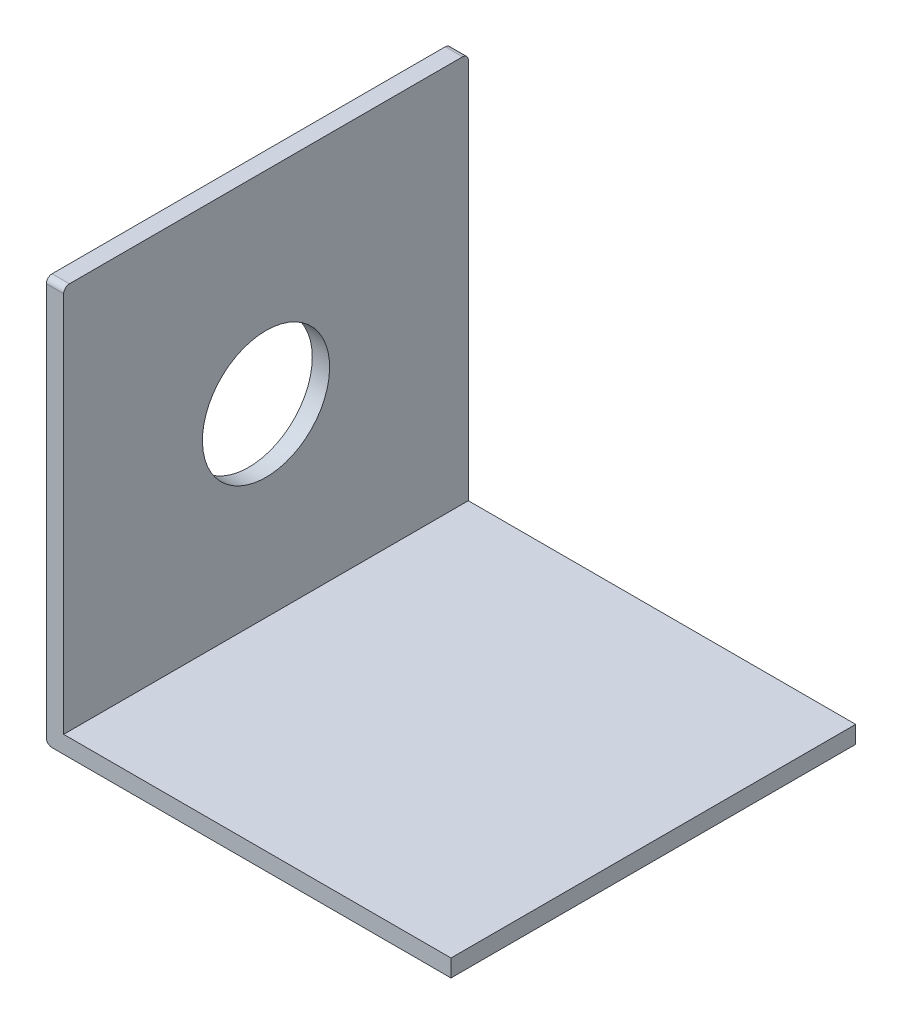
ISO-10303-21;
HEADER;
FILE_DESCRIPTION(('STEP AP214'),'2;1');
FILE_NAME('part.step','',(''),(''),'','','');
FILE_SCHEMA(('AUTOMOTIVE_DESIGN { 1 0 10303 214 1 1 1 1 }'));
ENDSEC;
DATA;
#1=APPLICATION_CONTEXT('core data for automotive mechanical design processes');
#2=APPLICATION_PROTOCOL_DEFINITION('international standard','automotive_design',2000,#1);
#3=PRODUCT_CONTEXT('',#1,'mechanical');
#4=PRODUCT('Part','Part','',(#3));
#5=PRODUCT_RELATED_PRODUCT_CATEGORY('part','',(#4));
#6=PRODUCT_DEFINITION_FORMATION('','',#4);
#7=PRODUCT_DEFINITION_CONTEXT('part definition',#1,'design');
#8=PRODUCT_DEFINITION('design','',#6,#7);
#9=PRODUCT_DEFINITION_SHAPE('','',#8);
#10=(LENGTH_UNIT() NAMED_UNIT(*) SI_UNIT(.MILLI.,.METRE.));
#11=(NAMED_UNIT(*) PLANE_ANGLE_UNIT() SI_UNIT($,.RADIAN.));
#12=(NAMED_UNIT(*) SI_UNIT($,.STERADIAN.) SOLID_ANGLE_UNIT());
#13=UNCERTAINTY_MEASURE_WITH_UNIT(LENGTH_MEASURE(1.E-05),#10,'distance_accuracy_value','');
#14=(GEOMETRIC_REPRESENTATION_CONTEXT(3) GLOBAL_UNCERTAINTY_ASSIGNED_CONTEXT((#13)) GLOBAL_UNIT_ASSIGNED_CONTEXT((#10,
#11,#12)) REPRESENTATION_CONTEXT('',''));
#15=CARTESIAN_POINT('',(0.,0.,0.));
#16=DIRECTION('',(0.,0.,1.));
#17=DIRECTION('',(1.,0.,0.));
#18=AXIS2_PLACEMENT_3D('',#15,#16,#17);
#19=CARTESIAN_POINT('',(0.,0.,70.));
#20=DIRECTION('',(1.,0.,0.));
#21=DIRECTION('',(0.,0.,-1.));
#22=AXIS2_PLACEMENT_3D('',#19,#20,#21);
#23=PLANE('',#22);
#24=CARTESIAN_POINT('',(0.,35.,35.));
#25=DIRECTION('',(1.,0.,0.));
#26=DIRECTION('',(0.,0.,-1.));
#27=AXIS2_PLACEMENT_3D('',#24,#25,#26);
#28=CIRCLE('',#27,11.);
#29=CARTESIAN_POINT('',(0.,35.,24.));
#30=VERTEX_POINT('',#29);
#31=EDGE_CURVE('E153',#30,#30,#28,.T.);
#32=ORIENTED_EDGE('',*,*,#31,.T.);
#33=EDGE_LOOP('',(#32));
#34=FACE_BOUND('',#33,.T.);
#35=DIRECTION('',(0.,-1.,0.));
#36=VECTOR('',#35,1.);
#37=CARTESIAN_POINT('',(0.,0.,70.));
#38=LINE('',#37,#36);
#39=CARTESIAN_POINT('',(0.,69.,70.));
#40=VERTEX_POINT('',#39);
#41=CARTESIAN_POINT('',(0.,1.,70.));
#42=VERTEX_POINT('',#41);
#43=EDGE_CURVE('E122',#40,#42,#38,.T.);
#44=ORIENTED_EDGE('',*,*,#43,.F.);
#45=CARTESIAN_POINT('',(0.,69.,69.));
#46=DIRECTION('',(1.,0.,0.));
#47=DIRECTION('',(0.,0.,-1.));
#48=AXIS2_PLACEMENT_3D('',#45,#46,#47);
#49=CIRCLE('',#48,1.);
#50=CARTESIAN_POINT('',(0.,70.,69.));
#51=VERTEX_POINT('',#50);
#52=EDGE_CURVE('E196',#40,#51,#49,.F.);
#53=ORIENTED_EDGE('',*,*,#52,.T.);
#54=DIRECTION('',(0.,0.,-1.));
#55=VECTOR('',#54,1.);
#56=CARTESIAN_POINT('',(0.,70.,70.));
#57=LINE('',#56,#55);
#58=CARTESIAN_POINT('',(0.,70.,1.));
#59=VERTEX_POINT('',#58);
#60=EDGE_CURVE('E149',#51,#59,#57,.T.);
#61=ORIENTED_EDGE('',*,*,#60,.T.);
#62=CARTESIAN_POINT('',(0.,69.,1.));
#63=DIRECTION('',(1.,0.,0.));
#64=DIRECTION('',(0.,0.,-1.));
#65=AXIS2_PLACEMENT_3D('',#62,#63,#64);
#66=CIRCLE('',#65,1.);
#67=CARTESIAN_POINT('',(0.,69.,0.));
#68=VERTEX_POINT('',#67);
#69=EDGE_CURVE('E193',#59,#68,#66,.F.);
#70=ORIENTED_EDGE('',*,*,#69,.T.);
#71=DIRECTION('',(0.,-1.,0.));
#72=VECTOR('',#71,1.);
#73=CARTESIAN_POINT('',(0.,0.,0.));
#74=LINE('',#73,#72);
#75=CARTESIAN_POINT('',(0.,1.,0.));
#76=VERTEX_POINT('',#75);
#77=EDGE_CURVE('E150',#68,#76,#74,.T.);
#78=ORIENTED_EDGE('',*,*,#77,.T.);
#79=DIRECTION('',(0.,0.,-1.));
#80=VECTOR('',#79,1.);
#81=CARTESIAN_POINT('',(0.,1.,70.));
#82=LINE('',#81,#80);
#83=EDGE_CURVE('E183',#76,#42,#82,.F.);
#84=ORIENTED_EDGE('',*,*,#83,.T.);
#85=EDGE_LOOP('',(#44,#53,#61,#70,#78,#84));
#86=FACE_BOUND('',#85,.T.);
#87=ADVANCED_FACE('F37',(#34,#86),#23,.F.);
#88=CARTESIAN_POINT('',(0.,0.,70.));
#89=DIRECTION('',(0.,1.,0.));
#90=DIRECTION('',(0.,0.,1.));
#91=AXIS2_PLACEMENT_3D('',#88,#89,#90);
#92=PLANE('',#91);
#93=DIRECTION('',(1.,0.,0.));
#94=VECTOR('',#93,1.);
#95=CARTESIAN_POINT('',(0.,0.,70.));
#96=LINE('',#95,#94);
#97=CARTESIAN_POINT('',(1.,0.,70.));
#98=VERTEX_POINT('',#97);
#99=CARTESIAN_POINT('',(70.,0.,70.));
#100=VERTEX_POINT('',#99);
#101=EDGE_CURVE('E109',#98,#100,#96,.T.);
#102=ORIENTED_EDGE('',*,*,#101,.F.);
#103=DIRECTION('',(0.,0.,-1.));
#104=VECTOR('',#103,1.);
#105=CARTESIAN_POINT('',(1.,0.,70.));
#106=LINE('',#105,#104);
#107=CARTESIAN_POINT('',(1.,0.,0.));
#108=VERTEX_POINT('',#107);
#109=EDGE_CURVE('E132',#98,#108,#106,.T.);
#110=ORIENTED_EDGE('',*,*,#109,.T.);
#111=DIRECTION('',(1.,0.,0.));
#112=VECTOR('',#111,1.);
#113=CARTESIAN_POINT('',(0.,0.,0.));
#114=LINE('',#113,#112);
#115=CARTESIAN_POINT('',(70.,0.,0.));
#116=VERTEX_POINT('',#115);
#117=EDGE_CURVE('E128',#108,#116,#114,.T.);
#118=ORIENTED_EDGE('',*,*,#117,.T.);
#119=DIRECTION('',(0.,0.,-1.));
#120=VECTOR('',#119,1.);
#121=CARTESIAN_POINT('',(70.,0.,70.));
#122=LINE('',#121,#120);
#123=EDGE_CURVE('E125',#100,#116,#122,.T.);
#124=ORIENTED_EDGE('',*,*,#123,.F.);
#125=EDGE_LOOP('',(#102,#110,#118,#124));
#126=FACE_BOUND('',#125,.T.);
#127=ADVANCED_FACE('F126',(#126),#92,.F.);
#128=CARTESIAN_POINT('',(70.,3.,70.));
#129=DIRECTION('',(-1.,0.,0.));
#130=DIRECTION('',(0.,0.,1.));
#131=AXIS2_PLACEMENT_3D('',#128,#129,#130);
#132=PLANE('',#131);
#133=DIRECTION('',(0.,1.,0.));
#134=VECTOR('',#133,1.);
#135=CARTESIAN_POINT('',(70.,3.,0.));
#136=LINE('',#135,#134);
#137=CARTESIAN_POINT('',(70.,3.,0.));
#138=VERTEX_POINT('',#137);
#139=EDGE_CURVE('E156',#116,#138,#136,.T.);
#140=ORIENTED_EDGE('',*,*,#139,.T.);
#141=DIRECTION('',(0.,0.,-1.));
#142=VECTOR('',#141,1.);
#143=CARTESIAN_POINT('',(70.,3.,70.));
#144=LINE('',#143,#142);
#145=CARTESIAN_POINT('',(70.,3.,70.));
#146=VERTEX_POINT('',#145);
#147=EDGE_CURVE('E133',#146,#138,#144,.T.);
#148=ORIENTED_EDGE('',*,*,#147,.F.);
#149=DIRECTION('',(0.,1.,0.));
#150=VECTOR('',#149,1.);
#151=CARTESIAN_POINT('',(70.,3.,70.));
#152=LINE('',#151,#150);
#153=EDGE_CURVE('E114',#100,#146,#152,.T.);
#154=ORIENTED_EDGE('',*,*,#153,.F.);
#155=ORIENTED_EDGE('',*,*,#123,.T.);
#156=EDGE_LOOP('',(#140,#148,#154,#155));
#157=FACE_BOUND('',#156,.T.);
#158=ADVANCED_FACE('F135',(#157),#132,.F.);
#159=CARTESIAN_POINT('',(3.,3.,70.));
#160=DIRECTION('',(0.,-1.,0.));
#161=DIRECTION('',(0.,0.,-1.));
#162=AXIS2_PLACEMENT_3D('',#159,#160,#161);
#163=PLANE('',#162);
#164=DIRECTION('',(-1.,0.,0.));
#165=VECTOR('',#164,1.);
#166=CARTESIAN_POINT('',(3.,3.,0.));
#167=LINE('',#166,#165);
#168=CARTESIAN_POINT('',(3.,3.,0.));
#169=VERTEX_POINT('',#168);
#170=EDGE_CURVE('E159',#138,#169,#167,.T.);
#171=ORIENTED_EDGE('',*,*,#170,.T.);
#172=DIRECTION('',(0.,0.,-1.));
#173=VECTOR('',#172,1.);
#174=CARTESIAN_POINT('',(3.,3.,70.));
#175=LINE('',#174,#173);
#176=CARTESIAN_POINT('',(3.,3.,70.));
#177=VERTEX_POINT('',#176);
#178=EDGE_CURVE('E171',#177,#169,#175,.T.);
#179=ORIENTED_EDGE('',*,*,#178,.F.);
#180=DIRECTION('',(-1.,0.,0.));
#181=VECTOR('',#180,1.);
#182=CARTESIAN_POINT('',(3.,3.,70.));
#183=LINE('',#182,#181);
#184=EDGE_CURVE('E139',#146,#177,#183,.T.);
#185=ORIENTED_EDGE('',*,*,#184,.F.);
#186=ORIENTED_EDGE('',*,*,#147,.T.);
#187=EDGE_LOOP('',(#171,#179,#185,#186));
#188=FACE_BOUND('',#187,.T.);
#189=ADVANCED_FACE('F248',(#188),#163,.F.);
#190=CARTESIAN_POINT('',(3.,70.,70.));
#191=DIRECTION('',(-1.,0.,0.));
#192=DIRECTION('',(0.,-1.,0.));
#193=AXIS2_PLACEMENT_3D('',#190,#191,#192);
#194=PLANE('',#193);
#195=CARTESIAN_POINT('',(3.,35.,35.));
#196=DIRECTION('',(1.,0.,0.));
#197=DIRECTION('',(0.,1.,0.));
#198=AXIS2_PLACEMENT_3D('',#195,#196,#197);
#199=CIRCLE('',#198,11.);
#200=CARTESIAN_POINT('',(3.,46.,35.));
#201=VERTEX_POINT('',#200);
#202=EDGE_CURVE('E355',#201,#201,#199,.T.);
#203=ORIENTED_EDGE('',*,*,#202,.F.);
#204=EDGE_LOOP('',(#203));
#205=FACE_BOUND('',#204,.T.);
#206=DIRECTION('',(0.,0.,-1.));
#207=VECTOR('',#206,1.);
#208=CARTESIAN_POINT('',(3.,70.,70.));
#209=LINE('',#208,#207);
#210=CARTESIAN_POINT('',(3.,70.,69.));
#211=VERTEX_POINT('',#210);
#212=CARTESIAN_POINT('',(3.,70.,1.));
#213=VERTEX_POINT('',#212);
#214=EDGE_CURVE('E168',#211,#213,#209,.T.);
#215=ORIENTED_EDGE('',*,*,#214,.F.);
#216=CARTESIAN_POINT('',(3.,69.,69.));
#217=DIRECTION('',(-1.,0.,0.));
#218=DIRECTION('',(0.,-1.,0.));
#219=AXIS2_PLACEMENT_3D('',#216,#217,#218);
#220=CIRCLE('',#219,1.);
#221=CARTESIAN_POINT('',(3.,69.,70.));
#222=VERTEX_POINT('',#221);
#223=EDGE_CURVE('E46',#211,#222,#220,.F.);
#224=ORIENTED_EDGE('',*,*,#223,.T.);
#225=DIRECTION('',(0.,1.,0.));
#226=VECTOR('',#225,1.);
#227=CARTESIAN_POINT('',(3.,70.,70.));
#228=LINE('',#227,#226);
#229=EDGE_CURVE('E143',#177,#222,#228,.T.);
#230=ORIENTED_EDGE('',*,*,#229,.F.);
#231=ORIENTED_EDGE('',*,*,#178,.T.);
#232=DIRECTION('',(0.,1.,0.));
#233=VECTOR('',#232,1.);
#234=CARTESIAN_POINT('',(3.,70.,0.));
#235=LINE('',#234,#233);
#236=CARTESIAN_POINT('',(3.,69.,0.));
#237=VERTEX_POINT('',#236);
#238=EDGE_CURVE('E162',#169,#237,#235,.T.);
#239=ORIENTED_EDGE('',*,*,#238,.T.);
#240=CARTESIAN_POINT('',(3.,69.,1.));
#241=DIRECTION('',(-1.,0.,0.));
#242=DIRECTION('',(0.,-1.,0.));
#243=AXIS2_PLACEMENT_3D('',#240,#241,#242);
#244=CIRCLE('',#243,1.);
#245=EDGE_CURVE('E58',#237,#213,#244,.F.);
#246=ORIENTED_EDGE('',*,*,#245,.T.);
#247=EDGE_LOOP('',(#215,#224,#230,#231,#239,#246));
#248=FACE_BOUND('',#247,.T.);
#249=ADVANCED_FACE('F211',(#205,#248),#194,.F.);
#250=CARTESIAN_POINT('',(0.,70.,70.));
#251=DIRECTION('',(0.,-1.,0.));
#252=DIRECTION('',(0.,0.,-1.));
#253=AXIS2_PLACEMENT_3D('',#250,#251,#252);
#254=PLANE('',#253);
#255=ORIENTED_EDGE('',*,*,#60,.F.);
#256=DIRECTION('',(-1.,0.,0.));
#257=VECTOR('',#256,1.);
#258=CARTESIAN_POINT('',(0.,70.,69.));
#259=LINE('',#258,#257);
#260=EDGE_CURVE('E203',#51,#211,#259,.F.);
#261=ORIENTED_EDGE('',*,*,#260,.T.);
#262=ORIENTED_EDGE('',*,*,#214,.T.);
#263=DIRECTION('',(-1.,0.,0.));
#264=VECTOR('',#263,1.);
#265=CARTESIAN_POINT('',(0.,70.,1.));
#266=LINE('',#265,#264);
#267=EDGE_CURVE('E199',#213,#59,#266,.T.);
#268=ORIENTED_EDGE('',*,*,#267,.T.);
#269=EDGE_LOOP('',(#255,#261,#262,#268));
#270=FACE_BOUND('',#269,.T.);
#271=ADVANCED_FACE('F221',(#270),#254,.F.);
#272=CARTESIAN_POINT('',(0.,0.,70.));
#273=DIRECTION('',(0.,0.,-1.));
#274=DIRECTION('',(-1.,0.,0.));
#275=AXIS2_PLACEMENT_3D('',#272,#273,#274);
#276=PLANE('',#275);
#277=ORIENTED_EDGE('',*,*,#229,.T.);
#278=DIRECTION('',(-1.,0.,0.));
#279=VECTOR('',#278,1.);
#280=CARTESIAN_POINT('',(0.,69.,70.));
#281=LINE('',#280,#279);
#282=EDGE_CURVE('E189',#222,#40,#281,.T.);
#283=ORIENTED_EDGE('',*,*,#282,.T.);
#284=ORIENTED_EDGE('',*,*,#43,.T.);
#285=CARTESIAN_POINT('',(1.,1.,70.));
#286=DIRECTION('',(0.,0.,-1.));
#287=DIRECTION('',(-1.,0.,0.));
#288=AXIS2_PLACEMENT_3D('',#285,#286,#287);
#289=CIRCLE('',#288,1.);
#290=EDGE_CURVE('E117',#42,#98,#289,.F.);
#291=ORIENTED_EDGE('',*,*,#290,.T.);
#292=ORIENTED_EDGE('',*,*,#101,.T.);
#293=ORIENTED_EDGE('',*,*,#153,.T.);
#294=ORIENTED_EDGE('',*,*,#184,.T.);
#295=EDGE_LOOP('',(#277,#283,#284,#291,#292,#293,#294));
#296=FACE_BOUND('',#295,.T.);
#297=ADVANCED_FACE('F112',(#296),#276,.F.);
#298=CARTESIAN_POINT('',(0.,0.,0.));
#299=DIRECTION('',(0.,0.,-1.));
#300=DIRECTION('',(-1.,0.,0.));
#301=AXIS2_PLACEMENT_3D('',#298,#299,#300);
#302=PLANE('',#301);
#303=ORIENTED_EDGE('',*,*,#77,.F.);
#304=DIRECTION('',(-1.,0.,0.));
#305=VECTOR('',#304,1.);
#306=CARTESIAN_POINT('',(3.,69.,0.));
#307=LINE('',#306,#305);
#308=EDGE_CURVE('E11',#68,#237,#307,.F.);
#309=ORIENTED_EDGE('',*,*,#308,.T.);
#310=ORIENTED_EDGE('',*,*,#238,.F.);
#311=ORIENTED_EDGE('',*,*,#170,.F.);
#312=ORIENTED_EDGE('',*,*,#139,.F.);
#313=ORIENTED_EDGE('',*,*,#117,.F.);
#314=CARTESIAN_POINT('',(1.,1.,0.));
#315=DIRECTION('',(0.,0.,-1.));
#316=DIRECTION('',(-1.,0.,0.));
#317=AXIS2_PLACEMENT_3D('',#314,#315,#316);
#318=CIRCLE('',#317,1.);
#319=EDGE_CURVE('E179',#108,#76,#318,.T.);
#320=ORIENTED_EDGE('',*,*,#319,.T.);
#321=EDGE_LOOP('',(#303,#309,#310,#311,#312,#313,#320));
#322=FACE_BOUND('',#321,.T.);
#323=ADVANCED_FACE('F224',(#322),#302,.T.);
#324=CARTESIAN_POINT('',(-67.,35.,35.));
#325=DIRECTION('',(1.,0.,0.));
#326=DIRECTION('',(0.,1.,0.));
#327=AXIS2_PLACEMENT_3D('',#324,#325,#326);
#328=CYLINDRICAL_SURFACE('',#327,11.);
#329=ORIENTED_EDGE('',*,*,#202,.T.);
#330=EDGE_LOOP('',(#329));
#331=FACE_BOUND('',#330,.T.);
#332=ORIENTED_EDGE('',*,*,#31,.F.);
#333=EDGE_LOOP('',(#332));
#334=FACE_BOUND('',#333,.T.);
#335=ADVANCED_FACE('F229',(#331,#334),#328,.F.);
#336=CARTESIAN_POINT('',(1.,1.,70.));
#337=DIRECTION('',(0.,0.,-1.));
#338=DIRECTION('',(-1.,0.,0.));
#339=AXIS2_PLACEMENT_3D('',#336,#337,#338);
#340=CYLINDRICAL_SURFACE('',#339,1.);
#341=ORIENTED_EDGE('',*,*,#290,.F.);
#342=ORIENTED_EDGE('',*,*,#83,.F.);
#343=ORIENTED_EDGE('',*,*,#319,.F.);
#344=ORIENTED_EDGE('',*,*,#109,.F.);
#345=EDGE_LOOP('',(#341,#342,#343,#344));
#346=FACE_BOUND('',#345,.T.);
#347=ADVANCED_FACE('F227',(#346),#340,.T.);
#348=CARTESIAN_POINT('',(0.,69.,69.));
#349=DIRECTION('',(-1.,0.,0.));
#350=DIRECTION('',(0.,0.,1.));
#351=AXIS2_PLACEMENT_3D('',#348,#349,#350);
#352=CYLINDRICAL_SURFACE('',#351,1.);
#353=ORIENTED_EDGE('',*,*,#223,.F.);
#354=ORIENTED_EDGE('',*,*,#260,.F.);
#355=ORIENTED_EDGE('',*,*,#52,.F.);
#356=ORIENTED_EDGE('',*,*,#282,.F.);
#357=EDGE_LOOP('',(#353,#354,#355,#356));
#358=FACE_BOUND('',#357,.T.);
#359=ADVANCED_FACE('F217',(#358),#352,.T.);
#360=CARTESIAN_POINT('',(0.,69.,1.));
#361=DIRECTION('',(1.,0.,0.));
#362=DIRECTION('',(0.,0.,-1.));
#363=AXIS2_PLACEMENT_3D('',#360,#361,#362);
#364=CYLINDRICAL_SURFACE('',#363,1.);
#365=ORIENTED_EDGE('',*,*,#245,.F.);
#366=ORIENTED_EDGE('',*,*,#308,.F.);
#367=ORIENTED_EDGE('',*,*,#69,.F.);
#368=ORIENTED_EDGE('',*,*,#267,.F.);
#369=EDGE_LOOP('',(#365,#366,#367,#368));
#370=FACE_BOUND('',#369,.T.);
#371=ADVANCED_FACE('F39',(#370),#364,.T.);
#372=CLOSED_SHELL('',(#87,#127,#158,#189,#249,#271,#297,#323,#335,#347,#359,#371));
#373=MANIFOLD_SOLID_BREP('B2',#372);
#374=ADVANCED_BREP_SHAPE_REPRESENTATION('',(#18,#373),#14);
#375=SHAPE_DEFINITION_REPRESENTATION(#9,#374);
ENDSEC;
END-ISO-10303-21;
